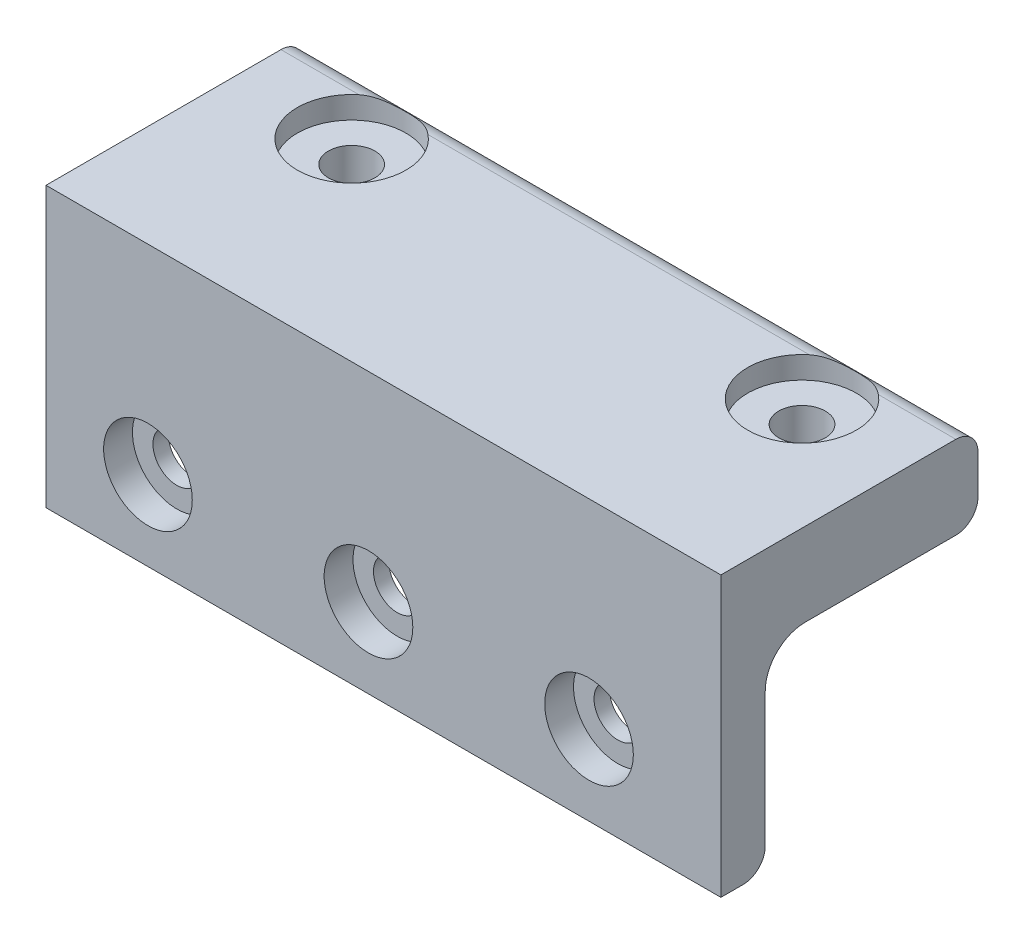
ISO-10303-21;
HEADER;
FILE_DESCRIPTION(('STEP AP214'),'2;1');
FILE_NAME('part.step','',(''),(''),'','','');
FILE_SCHEMA(('AUTOMOTIVE_DESIGN { 1 0 10303 214 1 1 1 1 }'));
ENDSEC;
DATA;
#1=APPLICATION_CONTEXT('core data for automotive mechanical design processes');
#2=APPLICATION_PROTOCOL_DEFINITION('international standard','automotive_design',2000,#1);
#3=PRODUCT_CONTEXT('',#1,'mechanical');
#4=PRODUCT('Part','Part','',(#3));
#5=PRODUCT_RELATED_PRODUCT_CATEGORY('part','',(#4));
#6=PRODUCT_DEFINITION_FORMATION('','',#4);
#7=PRODUCT_DEFINITION_CONTEXT('part definition',#1,'design');
#8=PRODUCT_DEFINITION('design','',#6,#7);
#9=PRODUCT_DEFINITION_SHAPE('','',#8);
#10=(LENGTH_UNIT() NAMED_UNIT(*) SI_UNIT(.MILLI.,.METRE.));
#11=(NAMED_UNIT(*) PLANE_ANGLE_UNIT() SI_UNIT($,.RADIAN.));
#12=(NAMED_UNIT(*) SI_UNIT($,.STERADIAN.) SOLID_ANGLE_UNIT());
#13=UNCERTAINTY_MEASURE_WITH_UNIT(LENGTH_MEASURE(1.E-05),#10,'distance_accuracy_value','');
#14=(GEOMETRIC_REPRESENTATION_CONTEXT(3) GLOBAL_UNCERTAINTY_ASSIGNED_CONTEXT((#13)) GLOBAL_UNIT_ASSIGNED_CONTEXT((#10,
#11,#12)) REPRESENTATION_CONTEXT('',''));
#15=CARTESIAN_POINT('',(0.,0.,0.));
#16=DIRECTION('',(0.,0.,1.));
#17=DIRECTION('',(1.,0.,0.));
#18=AXIS2_PLACEMENT_3D('',#15,#16,#17);
#19=CARTESIAN_POINT('',(0.,0.,-4.));
#20=DIRECTION('',(0.,0.,1.));
#21=DIRECTION('',(1.,0.,0.));
#22=AXIS2_PLACEMENT_3D('',#19,#20,#21);
#23=PLANE('',#22);
#24=CARTESIAN_POINT('',(49.,-18.,-4.));
#25=DIRECTION('',(0.,0.,1.));
#26=DIRECTION('',(1.,0.,0.));
#27=AXIS2_PLACEMENT_3D('',#24,#25,#26);
#28=CIRCLE('',#27,2.15);
#29=CARTESIAN_POINT('',(51.15,-18.,-4.));
#30=VERTEX_POINT('',#29);
#31=EDGE_CURVE('E351',#30,#30,#28,.T.);
#32=ORIENTED_EDGE('',*,*,#31,.T.);
#33=EDGE_LOOP('',(#32));
#34=FACE_BOUND('',#33,.T.);
#35=CARTESIAN_POINT('',(29.1,-18.,-4.));
#36=DIRECTION('',(0.,0.,1.));
#37=DIRECTION('',(1.,0.,0.));
#38=AXIS2_PLACEMENT_3D('',#35,#36,#37);
#39=CIRCLE('',#38,2.15);
#40=CARTESIAN_POINT('',(31.25,-18.,-4.));
#41=VERTEX_POINT('',#40);
#42=EDGE_CURVE('E362',#41,#41,#39,.T.);
#43=ORIENTED_EDGE('',*,*,#42,.T.);
#44=EDGE_LOOP('',(#43));
#45=FACE_BOUND('',#44,.T.);
#46=CARTESIAN_POINT('',(9.2,-18.,-4.));
#47=DIRECTION('',(0.,0.,1.));
#48=DIRECTION('',(1.,0.,0.));
#49=AXIS2_PLACEMENT_3D('',#46,#47,#48);
#50=CIRCLE('',#49,2.15);
#51=CARTESIAN_POINT('',(11.35,-18.,-4.));
#52=VERTEX_POINT('',#51);
#53=EDGE_CURVE('E357',#52,#52,#50,.T.);
#54=ORIENTED_EDGE('',*,*,#53,.T.);
#55=EDGE_LOOP('',(#54));
#56=FACE_BOUND('',#55,.T.);
#57=DIRECTION('',(0.,-1.,0.));
#58=VECTOR('',#57,1.);
#59=CARTESIAN_POINT('',(0.,0.,-4.));
#60=LINE('',#59,#58);
#61=CARTESIAN_POINT('',(0.,-11.1,-4.));
#62=VERTEX_POINT('',#61);
#63=CARTESIAN_POINT('',(0.,-23.2,-4.));
#64=VERTEX_POINT('',#63);
#65=EDGE_CURVE('E180',#62,#64,#60,.T.);
#66=ORIENTED_EDGE('',*,*,#65,.F.);
#67=DIRECTION('',(-1.,0.,0.));
#68=VECTOR('',#67,1.);
#69=CARTESIAN_POINT('',(0.,-11.1,-4.));
#70=LINE('',#69,#68);
#71=CARTESIAN_POINT('',(60.9,-11.1,-4.));
#72=VERTEX_POINT('',#71);
#73=EDGE_CURVE('E69',#62,#72,#70,.F.);
#74=ORIENTED_EDGE('',*,*,#73,.T.);
#75=DIRECTION('',(0.,1.,0.));
#76=VECTOR('',#75,1.);
#77=CARTESIAN_POINT('',(60.9,0.,-4.));
#78=LINE('',#77,#76);
#79=CARTESIAN_POINT('',(60.9,-23.2,-4.));
#80=VERTEX_POINT('',#79);
#81=EDGE_CURVE('E149',#80,#72,#78,.T.);
#82=ORIENTED_EDGE('',*,*,#81,.F.);
#83=DIRECTION('',(1.,0.,0.));
#84=VECTOR('',#83,1.);
#85=CARTESIAN_POINT('',(0.,-23.2,-4.));
#86=LINE('',#85,#84);
#87=EDGE_CURVE('E201',#80,#64,#86,.F.);
#88=ORIENTED_EDGE('',*,*,#87,.T.);
#89=EDGE_LOOP('',(#66,#74,#82,#88));
#90=FACE_BOUND('',#89,.T.);
#91=ADVANCED_FACE('F47',(#34,#45,#56,#90),#23,.F.);
#92=CARTESIAN_POINT('',(0.,0.,-4.));
#93=DIRECTION('',(-1.,0.,0.));
#94=DIRECTION('',(0.,0.,1.));
#95=AXIS2_PLACEMENT_3D('',#92,#93,#94);
#96=PLANE('',#95);
#97=DIRECTION('',(0.,0.,1.));
#98=VECTOR('',#97,1.);
#99=CARTESIAN_POINT('',(0.,-7.5,-4.));
#100=LINE('',#99,#98);
#101=CARTESIAN_POINT('',(0.,-7.5,-21.2));
#102=VERTEX_POINT('',#101);
#103=CARTESIAN_POINT('',(0.,-7.5,-7.6));
#104=VERTEX_POINT('',#103);
#105=EDGE_CURVE('E345',#102,#104,#100,.T.);
#106=ORIENTED_EDGE('',*,*,#105,.T.);
#107=CARTESIAN_POINT('',(0.,-11.1,-7.6));
#108=DIRECTION('',(-1.,0.,0.));
#109=DIRECTION('',(0.,0.,1.));
#110=AXIS2_PLACEMENT_3D('',#107,#108,#109);
#111=CIRCLE('',#110,3.6);
#112=EDGE_CURVE('E56',#104,#62,#111,.F.);
#113=ORIENTED_EDGE('',*,*,#112,.T.);
#114=ORIENTED_EDGE('',*,*,#65,.T.);
#115=CARTESIAN_POINT('',(0.,-23.2,-2.));
#116=DIRECTION('',(-1.,0.,0.));
#117=DIRECTION('',(0.,0.,1.));
#118=AXIS2_PLACEMENT_3D('',#115,#116,#117);
#119=CIRCLE('',#118,2.);
#120=CARTESIAN_POINT('',(0.,-25.2,-2.));
#121=VERTEX_POINT('',#120);
#122=EDGE_CURVE('E143',#64,#121,#119,.T.);
#123=ORIENTED_EDGE('',*,*,#122,.T.);
#124=DIRECTION('',(0.,0.,1.));
#125=VECTOR('',#124,1.);
#126=CARTESIAN_POINT('',(0.,-25.2,-4.));
#127=LINE('',#126,#125);
#128=CARTESIAN_POINT('',(0.,-25.2,0.));
#129=VERTEX_POINT('',#128);
#130=EDGE_CURVE('E135',#121,#129,#127,.T.);
#131=ORIENTED_EDGE('',*,*,#130,.T.);
#132=DIRECTION('',(0.,-1.,0.));
#133=VECTOR('',#132,1.);
#134=CARTESIAN_POINT('',(0.,0.,0.));
#135=LINE('',#134,#133);
#136=CARTESIAN_POINT('',(0.,0.,0.));
#137=VERTEX_POINT('',#136);
#138=EDGE_CURVE('E140',#137,#129,#135,.T.);
#139=ORIENTED_EDGE('',*,*,#138,.F.);
#140=DIRECTION('',(0.,0.,1.));
#141=VECTOR('',#140,1.);
#142=CARTESIAN_POINT('',(0.,0.,-4.));
#143=LINE('',#142,#141);
#144=CARTESIAN_POINT('',(0.,0.,-21.2));
#145=VERTEX_POINT('',#144);
#146=EDGE_CURVE('E181',#145,#137,#143,.T.);
#147=ORIENTED_EDGE('',*,*,#146,.F.);
#148=CARTESIAN_POINT('',(0.,-2.,-21.2));
#149=DIRECTION('',(-1.,0.,0.));
#150=DIRECTION('',(0.,0.,1.));
#151=AXIS2_PLACEMENT_3D('',#148,#149,#150);
#152=CIRCLE('',#151,2.);
#153=CARTESIAN_POINT('',(0.,-2.,-23.2));
#154=VERTEX_POINT('',#153);
#155=EDGE_CURVE('E205',#145,#154,#152,.T.);
#156=ORIENTED_EDGE('',*,*,#155,.T.);
#157=DIRECTION('',(0.,-1.,0.));
#158=VECTOR('',#157,1.);
#159=CARTESIAN_POINT('',(0.,-7.5,-23.2));
#160=LINE('',#159,#158);
#161=CARTESIAN_POINT('',(0.,-5.5,-23.2));
#162=VERTEX_POINT('',#161);
#163=EDGE_CURVE('E353',#154,#162,#160,.T.);
#164=ORIENTED_EDGE('',*,*,#163,.T.);
#165=CARTESIAN_POINT('',(0.,-5.5,-21.2));
#166=DIRECTION('',(-1.,0.,0.));
#167=DIRECTION('',(0.,0.,1.));
#168=AXIS2_PLACEMENT_3D('',#165,#166,#167);
#169=CIRCLE('',#168,2.);
#170=EDGE_CURVE('E208',#162,#102,#169,.T.);
#171=ORIENTED_EDGE('',*,*,#170,.T.);
#172=EDGE_LOOP('',(#106,#113,#114,#123,#131,#139,#147,#156,#164,#171));
#173=FACE_BOUND('',#172,.T.);
#174=ADVANCED_FACE('F137',(#173),#96,.T.);
#175=CARTESIAN_POINT('',(0.,0.,-4.));
#176=DIRECTION('',(0.,1.,0.));
#177=DIRECTION('',(0.,0.,1.));
#178=AXIS2_PLACEMENT_3D('',#175,#176,#177);
#179=PLANE('',#178);
#180=DIRECTION('',(0.,0.,1.));
#181=VECTOR('',#180,1.);
#182=CARTESIAN_POINT('',(60.9,0.,-4.));
#183=LINE('',#182,#181);
#184=CARTESIAN_POINT('',(60.9,0.,-21.2));
#185=VERTEX_POINT('',#184);
#186=CARTESIAN_POINT('',(60.9,0.,0.));
#187=VERTEX_POINT('',#186);
#188=EDGE_CURVE('E185',#185,#187,#183,.T.);
#189=ORIENTED_EDGE('',*,*,#188,.F.);
#190=DIRECTION('',(-1.,0.,0.));
#191=VECTOR('',#190,1.);
#192=CARTESIAN_POINT('',(0.,0.,-21.2));
#193=LINE('',#192,#191);
#194=CARTESIAN_POINT('',(53.9179480431848,0.,-21.2));
#195=VERTEX_POINT('',#194);
#196=EDGE_CURVE('E229',#185,#195,#193,.T.);
#197=ORIENTED_EDGE('',*,*,#196,.T.);
#198=CARTESIAN_POINT('',(50.8,0.,-17.42));
#199=DIRECTION('',(0.,1.,0.));
#200=DIRECTION('',(0.,0.,1.));
#201=AXIS2_PLACEMENT_3D('',#198,#199,#200);
#202=CIRCLE('',#201,4.9);
#203=CARTESIAN_POINT('',(47.6820519568152,0.,-21.2));
#204=VERTEX_POINT('',#203);
#205=EDGE_CURVE('E519',#204,#195,#202,.T.);
#206=ORIENTED_EDGE('',*,*,#205,.F.);
#207=DIRECTION('',(-1.,0.,0.));
#208=VECTOR('',#207,1.);
#209=CARTESIAN_POINT('',(0.,0.,-21.2));
#210=LINE('',#209,#208);
#211=CARTESIAN_POINT('',(13.2779480431848,0.,-21.2));
#212=VERTEX_POINT('',#211);
#213=EDGE_CURVE('E226',#204,#212,#210,.T.);
#214=ORIENTED_EDGE('',*,*,#213,.T.);
#215=CARTESIAN_POINT('',(10.16,0.,-17.42));
#216=DIRECTION('',(0.,1.,0.));
#217=DIRECTION('',(0.,0.,1.));
#218=AXIS2_PLACEMENT_3D('',#215,#216,#217);
#219=CIRCLE('',#218,4.9);
#220=CARTESIAN_POINT('',(7.04205195681517,0.,-21.2));
#221=VERTEX_POINT('',#220);
#222=EDGE_CURVE('E507',#221,#212,#219,.T.);
#223=ORIENTED_EDGE('',*,*,#222,.F.);
#224=DIRECTION('',(-1.,0.,0.));
#225=VECTOR('',#224,1.);
#226=CARTESIAN_POINT('',(0.,0.,-21.2));
#227=LINE('',#226,#225);
#228=EDGE_CURVE('E223',#221,#145,#227,.T.);
#229=ORIENTED_EDGE('',*,*,#228,.T.);
#230=ORIENTED_EDGE('',*,*,#146,.T.);
#231=DIRECTION('',(-1.,0.,0.));
#232=VECTOR('',#231,1.);
#233=CARTESIAN_POINT('',(0.,0.,0.));
#234=LINE('',#233,#232);
#235=EDGE_CURVE('E163',#187,#137,#234,.T.);
#236=ORIENTED_EDGE('',*,*,#235,.F.);
#237=EDGE_LOOP('',(#189,#197,#206,#214,#223,#229,#230,#236));
#238=FACE_BOUND('',#237,.T.);
#239=ADVANCED_FACE('F308',(#238),#179,.T.);
#240=CARTESIAN_POINT('',(60.9,0.,-4.));
#241=DIRECTION('',(1.,0.,0.));
#242=DIRECTION('',(0.,0.,-1.));
#243=AXIS2_PLACEMENT_3D('',#240,#241,#242);
#244=PLANE('',#243);
#245=DIRECTION('',(0.,0.,1.));
#246=VECTOR('',#245,1.);
#247=CARTESIAN_POINT('',(60.9,-25.2,-4.));
#248=LINE('',#247,#246);
#249=CARTESIAN_POINT('',(60.9,-25.2,-2.));
#250=VERTEX_POINT('',#249);
#251=CARTESIAN_POINT('',(60.9,-25.2,0.));
#252=VERTEX_POINT('',#251);
#253=EDGE_CURVE('E148',#250,#252,#248,.T.);
#254=ORIENTED_EDGE('',*,*,#253,.F.);
#255=CARTESIAN_POINT('',(60.9,-23.2,-2.));
#256=DIRECTION('',(1.,0.,0.));
#257=DIRECTION('',(0.,0.,-1.));
#258=AXIS2_PLACEMENT_3D('',#255,#256,#257);
#259=CIRCLE('',#258,2.);
#260=EDGE_CURVE('E198',#250,#80,#259,.T.);
#261=ORIENTED_EDGE('',*,*,#260,.T.);
#262=ORIENTED_EDGE('',*,*,#81,.T.);
#263=CARTESIAN_POINT('',(60.9,-11.1,-7.6));
#264=DIRECTION('',(1.,0.,0.));
#265=DIRECTION('',(0.,0.,-1.));
#266=AXIS2_PLACEMENT_3D('',#263,#264,#265);
#267=CIRCLE('',#266,3.6);
#268=CARTESIAN_POINT('',(60.9,-7.5,-7.6));
#269=VERTEX_POINT('',#268);
#270=EDGE_CURVE('E11',#72,#269,#267,.F.);
#271=ORIENTED_EDGE('',*,*,#270,.T.);
#272=DIRECTION('',(0.,0.,1.));
#273=VECTOR('',#272,1.);
#274=CARTESIAN_POINT('',(60.9,-7.5,-4.));
#275=LINE('',#274,#273);
#276=CARTESIAN_POINT('',(60.9,-7.5,-21.2));
#277=VERTEX_POINT('',#276);
#278=EDGE_CURVE('E340',#277,#269,#275,.T.);
#279=ORIENTED_EDGE('',*,*,#278,.F.);
#280=CARTESIAN_POINT('',(60.9,-5.5,-21.2));
#281=DIRECTION('',(1.,0.,0.));
#282=DIRECTION('',(0.,0.,-1.));
#283=AXIS2_PLACEMENT_3D('',#280,#281,#282);
#284=CIRCLE('',#283,2.);
#285=CARTESIAN_POINT('',(60.9,-5.5,-23.2));
#286=VERTEX_POINT('',#285);
#287=EDGE_CURVE('E195',#277,#286,#284,.T.);
#288=ORIENTED_EDGE('',*,*,#287,.T.);
#289=DIRECTION('',(0.,-1.,0.));
#290=VECTOR('',#289,1.);
#291=CARTESIAN_POINT('',(60.9,-7.5,-23.2));
#292=LINE('',#291,#290);
#293=CARTESIAN_POINT('',(60.9,-2.,-23.2));
#294=VERTEX_POINT('',#293);
#295=EDGE_CURVE('E337',#294,#286,#292,.T.);
#296=ORIENTED_EDGE('',*,*,#295,.F.);
#297=CARTESIAN_POINT('',(60.9,-2.,-21.2));
#298=DIRECTION('',(1.,0.,0.));
#299=DIRECTION('',(0.,0.,-1.));
#300=AXIS2_PLACEMENT_3D('',#297,#298,#299);
#301=CIRCLE('',#300,2.);
#302=EDGE_CURVE('E192',#294,#185,#301,.T.);
#303=ORIENTED_EDGE('',*,*,#302,.T.);
#304=ORIENTED_EDGE('',*,*,#188,.T.);
#305=DIRECTION('',(0.,1.,0.));
#306=VECTOR('',#305,1.);
#307=CARTESIAN_POINT('',(60.9,0.,0.));
#308=LINE('',#307,#306);
#309=EDGE_CURVE('E159',#252,#187,#308,.T.);
#310=ORIENTED_EDGE('',*,*,#309,.F.);
#311=EDGE_LOOP('',(#254,#261,#262,#271,#279,#288,#296,#303,#304,#310));
#312=FACE_BOUND('',#311,.T.);
#313=ADVANCED_FACE('F311',(#312),#244,.T.);
#314=CARTESIAN_POINT('',(0.,-25.2,-4.));
#315=DIRECTION('',(0.,-1.,0.));
#316=DIRECTION('',(0.,0.,-1.));
#317=AXIS2_PLACEMENT_3D('',#314,#315,#316);
#318=PLANE('',#317);
#319=ORIENTED_EDGE('',*,*,#130,.F.);
#320=DIRECTION('',(1.,0.,0.));
#321=VECTOR('',#320,1.);
#322=CARTESIAN_POINT('',(60.9,-25.2,-2.));
#323=LINE('',#322,#321);
#324=EDGE_CURVE('E184',#121,#250,#323,.T.);
#325=ORIENTED_EDGE('',*,*,#324,.T.);
#326=ORIENTED_EDGE('',*,*,#253,.T.);
#327=DIRECTION('',(1.,0.,0.));
#328=VECTOR('',#327,1.);
#329=CARTESIAN_POINT('',(0.,-25.2,0.));
#330=LINE('',#329,#328);
#331=EDGE_CURVE('E152',#129,#252,#330,.T.);
#332=ORIENTED_EDGE('',*,*,#331,.F.);
#333=EDGE_LOOP('',(#319,#325,#326,#332));
#334=FACE_BOUND('',#333,.T.);
#335=ADVANCED_FACE('F153',(#334),#318,.T.);
#336=CARTESIAN_POINT('',(0.,0.,0.));
#337=DIRECTION('',(0.,0.,1.));
#338=DIRECTION('',(1.,0.,0.));
#339=AXIS2_PLACEMENT_3D('',#336,#337,#338);
#340=PLANE('',#339);
#341=CARTESIAN_POINT('',(9.2,-18.,0.));
#342=DIRECTION('',(0.,0.,1.));
#343=DIRECTION('',(1.,0.,0.));
#344=AXIS2_PLACEMENT_3D('',#341,#342,#343);
#345=CIRCLE('',#344,4.);
#346=CARTESIAN_POINT('',(13.2,-18.,0.));
#347=VERTEX_POINT('',#346);
#348=EDGE_CURVE('E171',#347,#347,#345,.T.);
#349=ORIENTED_EDGE('',*,*,#348,.F.);
#350=EDGE_LOOP('',(#349));
#351=FACE_BOUND('',#350,.T.);
#352=CARTESIAN_POINT('',(29.1,-18.,0.));
#353=DIRECTION('',(0.,0.,1.));
#354=DIRECTION('',(1.,0.,0.));
#355=AXIS2_PLACEMENT_3D('',#352,#353,#354);
#356=CIRCLE('',#355,4.00000000000001);
#357=CARTESIAN_POINT('',(33.1,-18.,0.));
#358=VERTEX_POINT('',#357);
#359=EDGE_CURVE('E388',#358,#358,#356,.T.);
#360=ORIENTED_EDGE('',*,*,#359,.F.);
#361=EDGE_LOOP('',(#360));
#362=FACE_BOUND('',#361,.T.);
#363=CARTESIAN_POINT('',(49.,-18.,0.));
#364=DIRECTION('',(0.,0.,1.));
#365=DIRECTION('',(1.,0.,0.));
#366=AXIS2_PLACEMENT_3D('',#363,#364,#365);
#367=CIRCLE('',#366,4.00000000000001);
#368=CARTESIAN_POINT('',(53.,-18.,0.));
#369=VERTEX_POINT('',#368);
#370=EDGE_CURVE('E379',#369,#369,#367,.T.);
#371=ORIENTED_EDGE('',*,*,#370,.F.);
#372=EDGE_LOOP('',(#371));
#373=FACE_BOUND('',#372,.T.);
#374=ORIENTED_EDGE('',*,*,#138,.T.);
#375=ORIENTED_EDGE('',*,*,#331,.T.);
#376=ORIENTED_EDGE('',*,*,#309,.T.);
#377=ORIENTED_EDGE('',*,*,#235,.T.);
#378=EDGE_LOOP('',(#374,#375,#376,#377));
#379=FACE_BOUND('',#378,.T.);
#380=ADVANCED_FACE('F161',(#351,#362,#373,#379),#340,.T.);
#381=CARTESIAN_POINT('',(49.,-18.,-2.6));
#382=DIRECTION('',(0.,0.,1.));
#383=DIRECTION('',(1.,0.,0.));
#384=AXIS2_PLACEMENT_3D('',#381,#382,#383);
#385=CYLINDRICAL_SURFACE('',#384,4.00000000000001);
#386=CARTESIAN_POINT('',(49.,-18.,-2.6));
#387=DIRECTION('',(0.,0.,1.));
#388=DIRECTION('',(1.,0.,0.));
#389=AXIS2_PLACEMENT_3D('',#386,#387,#388);
#390=CIRCLE('',#389,4.00000000000001);
#391=CARTESIAN_POINT('',(53.,-18.,-2.6));
#392=VERTEX_POINT('',#391);
#393=EDGE_CURVE('E392',#392,#392,#390,.T.);
#394=ORIENTED_EDGE('',*,*,#393,.F.);
#395=EDGE_LOOP('',(#394));
#396=FACE_BOUND('',#395,.T.);
#397=ORIENTED_EDGE('',*,*,#370,.T.);
#398=EDGE_LOOP('',(#397));
#399=FACE_BOUND('',#398,.T.);
#400=ADVANCED_FACE('F297',(#396,#399),#385,.F.);
#401=CARTESIAN_POINT('',(49.,-18.,-2.6));
#402=DIRECTION('',(0.,0.,1.));
#403=DIRECTION('',(1.,0.,0.));
#404=AXIS2_PLACEMENT_3D('',#401,#402,#403);
#405=PLANE('',#404);
#406=CARTESIAN_POINT('',(49.,-18.,-2.6));
#407=DIRECTION('',(0.,0.,1.));
#408=DIRECTION('',(1.,0.,0.));
#409=AXIS2_PLACEMENT_3D('',#406,#407,#408);
#410=CIRCLE('',#409,2.15);
#411=CARTESIAN_POINT('',(51.15,-18.,-2.6));
#412=VERTEX_POINT('',#411);
#413=EDGE_CURVE('E376',#412,#412,#410,.T.);
#414=ORIENTED_EDGE('',*,*,#413,.F.);
#415=EDGE_LOOP('',(#414));
#416=FACE_BOUND('',#415,.T.);
#417=ORIENTED_EDGE('',*,*,#393,.T.);
#418=EDGE_LOOP('',(#417));
#419=FACE_BOUND('',#418,.T.);
#420=ADVANCED_FACE('F293',(#416,#419),#405,.T.);
#421=CARTESIAN_POINT('',(29.1,-18.,-2.6));
#422=DIRECTION('',(0.,0.,1.));
#423=DIRECTION('',(1.,0.,0.));
#424=AXIS2_PLACEMENT_3D('',#421,#422,#423);
#425=CYLINDRICAL_SURFACE('',#424,4.00000000000001);
#426=CARTESIAN_POINT('',(29.1,-18.,-2.6));
#427=DIRECTION('',(0.,0.,1.));
#428=DIRECTION('',(1.,0.,0.));
#429=AXIS2_PLACEMENT_3D('',#426,#427,#428);
#430=CIRCLE('',#429,4.00000000000001);
#431=CARTESIAN_POINT('',(33.1,-18.,-2.6));
#432=VERTEX_POINT('',#431);
#433=EDGE_CURVE('E384',#432,#432,#430,.T.);
#434=ORIENTED_EDGE('',*,*,#433,.F.);
#435=EDGE_LOOP('',(#434));
#436=FACE_BOUND('',#435,.T.);
#437=ORIENTED_EDGE('',*,*,#359,.T.);
#438=EDGE_LOOP('',(#437));
#439=FACE_BOUND('',#438,.T.);
#440=ADVANCED_FACE('F289',(#436,#439),#425,.F.);
#441=CARTESIAN_POINT('',(29.1,-18.,-2.6));
#442=DIRECTION('',(0.,0.,1.));
#443=DIRECTION('',(1.,0.,0.));
#444=AXIS2_PLACEMENT_3D('',#441,#442,#443);
#445=PLANE('',#444);
#446=CARTESIAN_POINT('',(29.1,-18.,-2.6));
#447=DIRECTION('',(0.,0.,1.));
#448=DIRECTION('',(1.,0.,0.));
#449=AXIS2_PLACEMENT_3D('',#446,#447,#448);
#450=CIRCLE('',#449,2.15);
#451=CARTESIAN_POINT('',(31.25,-18.,-2.6));
#452=VERTEX_POINT('',#451);
#453=EDGE_CURVE('E372',#452,#452,#450,.T.);
#454=ORIENTED_EDGE('',*,*,#453,.F.);
#455=EDGE_LOOP('',(#454));
#456=FACE_BOUND('',#455,.T.);
#457=ORIENTED_EDGE('',*,*,#433,.T.);
#458=EDGE_LOOP('',(#457));
#459=FACE_BOUND('',#458,.T.);
#460=ADVANCED_FACE('F285',(#456,#459),#445,.T.);
#461=CARTESIAN_POINT('',(9.2,-18.,-2.6));
#462=DIRECTION('',(0.,0.,1.));
#463=DIRECTION('',(1.,0.,0.));
#464=AXIS2_PLACEMENT_3D('',#461,#462,#463);
#465=CYLINDRICAL_SURFACE('',#464,4.);
#466=CARTESIAN_POINT('',(9.2,-18.,-2.6));
#467=DIRECTION('',(0.,0.,1.));
#468=DIRECTION('',(1.,0.,0.));
#469=AXIS2_PLACEMENT_3D('',#466,#467,#468);
#470=CIRCLE('',#469,4.);
#471=CARTESIAN_POINT('',(13.2,-18.,-2.6));
#472=VERTEX_POINT('',#471);
#473=EDGE_CURVE('E165',#472,#472,#470,.T.);
#474=ORIENTED_EDGE('',*,*,#473,.F.);
#475=EDGE_LOOP('',(#474));
#476=FACE_BOUND('',#475,.T.);
#477=ORIENTED_EDGE('',*,*,#348,.T.);
#478=EDGE_LOOP('',(#477));
#479=FACE_BOUND('',#478,.T.);
#480=ADVANCED_FACE('F281',(#476,#479),#465,.F.);
#481=CARTESIAN_POINT('',(9.2,-18.,-2.6));
#482=DIRECTION('',(0.,0.,1.));
#483=DIRECTION('',(1.,0.,0.));
#484=AXIS2_PLACEMENT_3D('',#481,#482,#483);
#485=PLANE('',#484);
#486=CARTESIAN_POINT('',(9.2,-18.,-2.6));
#487=DIRECTION('',(0.,0.,1.));
#488=DIRECTION('',(1.,0.,0.));
#489=AXIS2_PLACEMENT_3D('',#486,#487,#488);
#490=CIRCLE('',#489,2.15);
#491=CARTESIAN_POINT('',(11.35,-18.,-2.6));
#492=VERTEX_POINT('',#491);
#493=EDGE_CURVE('E361',#492,#492,#490,.T.);
#494=ORIENTED_EDGE('',*,*,#493,.F.);
#495=EDGE_LOOP('',(#494));
#496=FACE_BOUND('',#495,.T.);
#497=ORIENTED_EDGE('',*,*,#473,.T.);
#498=EDGE_LOOP('',(#497));
#499=FACE_BOUND('',#498,.T.);
#500=ADVANCED_FACE('F271',(#496,#499),#485,.T.);
#501=CARTESIAN_POINT('',(9.2,-18.,-4.));
#502=DIRECTION('',(0.,0.,1.));
#503=DIRECTION('',(1.,0.,0.));
#504=AXIS2_PLACEMENT_3D('',#501,#502,#503);
#505=CYLINDRICAL_SURFACE('',#504,2.15);
#506=ORIENTED_EDGE('',*,*,#493,.T.);
#507=EDGE_LOOP('',(#506));
#508=FACE_BOUND('',#507,.T.);
#509=ORIENTED_EDGE('',*,*,#53,.F.);
#510=EDGE_LOOP('',(#509));
#511=FACE_BOUND('',#510,.T.);
#512=ADVANCED_FACE('F267',(#508,#511),#505,.F.);
#513=CARTESIAN_POINT('',(29.1,-18.,-4.));
#514=DIRECTION('',(0.,0.,1.));
#515=DIRECTION('',(1.,0.,0.));
#516=AXIS2_PLACEMENT_3D('',#513,#514,#515);
#517=CYLINDRICAL_SURFACE('',#516,2.15);
#518=ORIENTED_EDGE('',*,*,#453,.T.);
#519=EDGE_LOOP('',(#518));
#520=FACE_BOUND('',#519,.T.);
#521=ORIENTED_EDGE('',*,*,#42,.F.);
#522=EDGE_LOOP('',(#521));
#523=FACE_BOUND('',#522,.T.);
#524=ADVANCED_FACE('F270',(#520,#523),#517,.F.);
#525=CARTESIAN_POINT('',(49.,-18.,-4.));
#526=DIRECTION('',(0.,0.,1.));
#527=DIRECTION('',(1.,0.,0.));
#528=AXIS2_PLACEMENT_3D('',#525,#526,#527);
#529=CYLINDRICAL_SURFACE('',#528,2.15);
#530=ORIENTED_EDGE('',*,*,#413,.T.);
#531=EDGE_LOOP('',(#530));
#532=FACE_BOUND('',#531,.T.);
#533=ORIENTED_EDGE('',*,*,#31,.F.);
#534=EDGE_LOOP('',(#533));
#535=FACE_BOUND('',#534,.T.);
#536=ADVANCED_FACE('F265',(#532,#535),#529,.F.);
#537=CARTESIAN_POINT('',(81.5128600635622,-7.5,-23.2));
#538=DIRECTION('',(0.,0.,-1.));
#539=DIRECTION('',(-1.,0.,0.));
#540=AXIS2_PLACEMENT_3D('',#537,#538,#539);
#541=PLANE('',#540);
#542=ORIENTED_EDGE('',*,*,#295,.T.);
#543=DIRECTION('',(-1.,0.,0.));
#544=VECTOR('',#543,1.);
#545=CARTESIAN_POINT('',(81.5128600635622,-5.5,-23.2));
#546=LINE('',#545,#544);
#547=EDGE_CURVE('E216',#286,#162,#546,.T.);
#548=ORIENTED_EDGE('',*,*,#547,.T.);
#549=ORIENTED_EDGE('',*,*,#163,.F.);
#550=DIRECTION('',(-1.,0.,0.));
#551=VECTOR('',#550,1.);
#552=CARTESIAN_POINT('',(81.5128600635622,-2.,-23.2));
#553=LINE('',#552,#551);
#554=EDGE_CURVE('E213',#154,#294,#553,.F.);
#555=ORIENTED_EDGE('',*,*,#554,.T.);
#556=EDGE_LOOP('',(#542,#548,#549,#555));
#557=FACE_BOUND('',#556,.T.);
#558=ADVANCED_FACE('F261',(#557),#541,.T.);
#559=CARTESIAN_POINT('',(81.5128600635622,-7.5,-4.));
#560=DIRECTION('',(0.,-1.,0.));
#561=DIRECTION('',(0.,0.,-1.));
#562=AXIS2_PLACEMENT_3D('',#559,#560,#561);
#563=PLANE('',#562);
#564=CARTESIAN_POINT('',(10.16,-7.5,-17.42));
#565=DIRECTION('',(0.,-1.,0.));
#566=DIRECTION('',(0.,0.,-1.));
#567=AXIS2_PLACEMENT_3D('',#564,#565,#566);
#568=CIRCLE('',#567,2.1);
#569=CARTESIAN_POINT('',(10.16,-7.5,-19.52));
#570=VERTEX_POINT('',#569);
#571=EDGE_CURVE('E537',#570,#570,#568,.T.);
#572=ORIENTED_EDGE('',*,*,#571,.F.);
#573=EDGE_LOOP('',(#572));
#574=FACE_BOUND('',#573,.T.);
#575=CARTESIAN_POINT('',(50.8,-7.5,-17.42));
#576=DIRECTION('',(0.,-1.,0.));
#577=DIRECTION('',(0.,0.,-1.));
#578=AXIS2_PLACEMENT_3D('',#575,#576,#577);
#579=CIRCLE('',#578,2.1);
#580=CARTESIAN_POINT('',(50.8,-7.5,-19.52));
#581=VERTEX_POINT('',#580);
#582=EDGE_CURVE('E525',#581,#581,#579,.T.);
#583=ORIENTED_EDGE('',*,*,#582,.F.);
#584=EDGE_LOOP('',(#583));
#585=FACE_BOUND('',#584,.T.);
#586=ORIENTED_EDGE('',*,*,#278,.T.);
#587=DIRECTION('',(-1.,0.,0.));
#588=VECTOR('',#587,1.);
#589=CARTESIAN_POINT('',(81.5128600635622,-7.5,-7.6));
#590=LINE('',#589,#588);
#591=EDGE_CURVE('E409',#269,#104,#590,.T.);
#592=ORIENTED_EDGE('',*,*,#591,.T.);
#593=ORIENTED_EDGE('',*,*,#105,.F.);
#594=DIRECTION('',(-1.,0.,0.));
#595=VECTOR('',#594,1.);
#596=CARTESIAN_POINT('',(81.5128600635622,-7.5,-21.2));
#597=LINE('',#596,#595);
#598=EDGE_CURVE('E220',#102,#277,#597,.F.);
#599=ORIENTED_EDGE('',*,*,#598,.T.);
#600=EDGE_LOOP('',(#586,#592,#593,#599));
#601=FACE_BOUND('',#600,.T.);
#602=ADVANCED_FACE('F257',(#574,#585,#601),#563,.T.);
#603=CARTESIAN_POINT('',(50.8,-2.,-17.42));
#604=DIRECTION('',(0.,1.,0.));
#605=DIRECTION('',(0.,0.,1.));
#606=AXIS2_PLACEMENT_3D('',#603,#604,#605);
#607=CYLINDRICAL_SURFACE('',#606,4.9);
#608=CARTESIAN_POINT('',(50.8,-2.,-17.42));
#609=DIRECTION('',(0.,1.,0.));
#610=DIRECTION('',(0.,0.,1.));
#611=AXIS2_PLACEMENT_3D('',#608,#609,#610);
#612=CIRCLE('',#611,4.9);
#613=CARTESIAN_POINT('',(50.8,-2.,-12.52));
#614=VERTEX_POINT('',#613);
#615=EDGE_CURVE('E513',#614,#614,#612,.T.);
#616=ORIENTED_EDGE('',*,*,#615,.F.);
#617=EDGE_LOOP('',(#616));
#618=FACE_BOUND('',#617,.T.);
#619=ORIENTED_EDGE('',*,*,#205,.T.);
#620=CARTESIAN_POINT('',(53.9179480431848,0.,-21.2));
#621=CARTESIAN_POINT('',(53.8286225644209,-3.0675038264168E-05,-21.2736980878322));
#622=CARTESIAN_POINT('',(53.7367648734642,-0.00406936007128253,-21.3441290641825));
#623=CARTESIAN_POINT('',(53.5487647093001,-0.0182695866944448,-21.4780231219697));
#624=CARTESIAN_POINT('',(53.4526296124482,-0.0284209391845195,-21.5414975914282));
#625=CARTESIAN_POINT('',(53.2564927669105,-0.052973509863096,-21.6613289961353));
#626=CARTESIAN_POINT('',(53.1564886728501,-0.0673773421125995,-21.7176815229043));
#627=CARTESIAN_POINT('',(52.9530892551673,-0.0987468928164648,-21.8231061956685));
#628=CARTESIAN_POINT('',(52.8496923379121,-0.115713829062475,-21.8721748588368));
#629=CARTESIAN_POINT('',(52.5251378285631,-0.16964317339516,-22.0125033307448));
#630=CARTESIAN_POINT('',(52.2986495393839,-0.208213408446666,-22.0913431852526));
#631=CARTESIAN_POINT('',(51.9514972089685,-0.258617100257546,-22.184284449134));
#632=CARTESIAN_POINT('',(51.8345893399293,-0.274171851852822,-22.2110397078179));
#633=CARTESIAN_POINT('',(51.5986933592542,-0.301281069561712,-22.2559574648274));
#634=CARTESIAN_POINT('',(51.4797063285671,-0.312837552961654,-22.2741242980576));
#635=CARTESIAN_POINT('',(51.2259317059516,-0.331755863979286,-22.3033174877994));
#636=CARTESIAN_POINT('',(51.0909621125236,-0.338447563191601,-22.3132247965783));
#637=CARTESIAN_POINT('',(50.8204964894312,-0.344241176294927,-22.3218246437891));
#638=CARTESIAN_POINT('',(50.685000455213,-0.343343024386568,-22.3205170849949));
#639=CARTESIAN_POINT('',(50.4146088610989,-0.334081753192582,-22.3066995378873));
#640=CARTESIAN_POINT('',(50.2797147572726,-0.325705640507999,-22.294170050688));
#641=CARTESIAN_POINT('',(50.0119844453416,-0.302692620863404,-22.2581082106502));
#642=CARTESIAN_POINT('',(49.8791483937745,-0.288055240063885,-22.2345750250625));
#643=CARTESIAN_POINT('',(49.5191682591489,-0.241996902905852,-22.1554245283381));
#644=CARTESIAN_POINT('',(49.2949259708706,-0.206169085939181,-22.0889503655215));
#645=CARTESIAN_POINT('',(48.8587434120391,-0.133925037975235,-21.925078483642));
#646=CARTESIAN_POINT('',(48.6467784710148,-0.0975101892869351,-21.8277455170835));
#647=CARTESIAN_POINT('',(48.3085142349436,-0.0479883270994945,-21.6420468590218));
#648=CARTESIAN_POINT('',(48.178031024732,-0.0311787991649147,-21.562307944892));
#649=CARTESIAN_POINT('',(47.9877617520339,-0.0131881402852733,-21.4333784099841));
#650=CARTESIAN_POINT('',(47.9251811912199,-0.00839389238785822,-21.3887934350069));
#651=CARTESIAN_POINT('',(47.8020391347446,-0.00180146380879246,-21.296616618862));
#652=CARTESIAN_POINT('',(47.7414792752736,-5.65595136367018E-06,-21.2490224272222));
#653=CARTESIAN_POINT('',(47.6820519568152,0.,-21.2));
#654=B_SPLINE_CURVE_WITH_KNOTS('',3,(#620,#621,#622,#623,#624,#625,#626,#627,#628,#629,#630,
#631,#632,#633,#634,#635,#636,#637,#638,#639,#640,#641,#642,#643,#644,#645,#646,#647,#648,#649,
#650,#651,#652,#653),.UNSPECIFIED.,.F.,.F.,(4,2,2,2,2,2,2,2,2,2,2,2,2,2,2,2,4),(0.,
0.347088434224056,0.693599908109185,1.04032483271248,1.38721501573261,2.11280285534163,
2.47531901717803,2.83765200745486,3.24348348450476,3.64931847986902,4.05586001291873,
4.46243231761509,5.16966415589307,5.87542168980395,6.33605671444324,6.56688959838062,
6.79790506616343),.UNSPECIFIED.);
#655=EDGE_CURVE('E233',#195,#204,#654,.T.);
#656=ORIENTED_EDGE('',*,*,#655,.T.);
#657=EDGE_LOOP('',(#619,#656));
#658=FACE_BOUND('',#657,.T.);
#659=ADVANCED_FACE('F251',(#618,#658),#607,.F.);
#660=CARTESIAN_POINT('',(50.8,-2.,-17.42));
#661=DIRECTION('',(0.,1.,0.));
#662=DIRECTION('',(0.,0.,1.));
#663=AXIS2_PLACEMENT_3D('',#660,#661,#662);
#664=PLANE('',#663);
#665=CARTESIAN_POINT('',(50.8,-2.,-17.42));
#666=DIRECTION('',(0.,1.,0.));
#667=DIRECTION('',(0.,0.,1.));
#668=AXIS2_PLACEMENT_3D('',#665,#666,#667);
#669=CIRCLE('',#668,2.1);
#670=CARTESIAN_POINT('',(50.8,-2.,-15.32));
#671=VERTEX_POINT('',#670);
#672=EDGE_CURVE('E531',#671,#671,#669,.T.);
#673=ORIENTED_EDGE('',*,*,#672,.F.);
#674=EDGE_LOOP('',(#673));
#675=FACE_BOUND('',#674,.T.);
#676=ORIENTED_EDGE('',*,*,#615,.T.);
#677=EDGE_LOOP('',(#676));
#678=FACE_BOUND('',#677,.T.);
#679=ADVANCED_FACE('F256',(#675,#678),#664,.T.);
#680=CARTESIAN_POINT('',(10.16,-2.,-17.42));
#681=DIRECTION('',(0.,1.,0.));
#682=DIRECTION('',(0.,0.,1.));
#683=AXIS2_PLACEMENT_3D('',#680,#681,#682);
#684=CYLINDRICAL_SURFACE('',#683,4.9);
#685=CARTESIAN_POINT('',(10.16,-2.,-17.42));
#686=DIRECTION('',(0.,1.,0.));
#687=DIRECTION('',(0.,0.,1.));
#688=AXIS2_PLACEMENT_3D('',#685,#686,#687);
#689=CIRCLE('',#688,4.9);
#690=CARTESIAN_POINT('',(10.16,-2.,-12.52));
#691=VERTEX_POINT('',#690);
#692=EDGE_CURVE('E502',#691,#691,#689,.T.);
#693=ORIENTED_EDGE('',*,*,#692,.F.);
#694=EDGE_LOOP('',(#693));
#695=FACE_BOUND('',#694,.T.);
#696=ORIENTED_EDGE('',*,*,#222,.T.);
#697=CARTESIAN_POINT('',(13.2779480431848,0.,-21.2));
#698=CARTESIAN_POINT('',(13.1886225644209,-3.06750382638274E-05,-21.2736980878322));
#699=CARTESIAN_POINT('',(13.0967648734642,-0.00406936007128211,-21.3441290641825));
#700=CARTESIAN_POINT('',(12.9087647093001,-0.0182695866944444,-21.4780231219697));
#701=CARTESIAN_POINT('',(12.8126296124482,-0.0284209391845191,-21.5414975914282));
#702=CARTESIAN_POINT('',(12.6164927669105,-0.0529735098630955,-21.6613289961353));
#703=CARTESIAN_POINT('',(12.5164886728501,-0.0673773421125986,-21.7176815229043));
#704=CARTESIAN_POINT('',(12.3130892551673,-0.0987468928164635,-21.8231061956685));
#705=CARTESIAN_POINT('',(12.2096923379121,-0.115713829062473,-21.8721748588368));
#706=CARTESIAN_POINT('',(11.8851378285631,-0.169643173395159,-22.0125033307448));
#707=CARTESIAN_POINT('',(11.6586495393839,-0.208213408446665,-22.0913431852526));
#708=CARTESIAN_POINT('',(11.3114972089685,-0.258617100257546,-22.184284449134));
#709=CARTESIAN_POINT('',(11.1945893399293,-0.274171851852822,-22.2110397078179));
#710=CARTESIAN_POINT('',(10.9586933592543,-0.301281069561711,-22.2559574648274));
#711=CARTESIAN_POINT('',(10.8397063285671,-0.312837552961654,-22.2741242980576));
#712=CARTESIAN_POINT('',(10.5859317059516,-0.331755863979286,-22.3033174877994));
#713=CARTESIAN_POINT('',(10.4509621125236,-0.338447563191603,-22.3132247965783));
#714=CARTESIAN_POINT('',(10.1804964894312,-0.344241176294929,-22.3218246437891));
#715=CARTESIAN_POINT('',(10.045000455213,-0.343343024386569,-22.3205170849949));
#716=CARTESIAN_POINT('',(9.77460886109891,-0.334081753192583,-22.3066995378873));
#717=CARTESIAN_POINT('',(9.63971475727261,-0.325705640508,-22.294170050688));
#718=CARTESIAN_POINT('',(9.37198444534162,-0.302692620863406,-22.2581082106502));
#719=CARTESIAN_POINT('',(9.23914839377452,-0.288055240063887,-22.2345750250625));
#720=CARTESIAN_POINT('',(8.8791682591489,-0.241996902905854,-22.1554245283381));
#721=CARTESIAN_POINT('',(8.65492597087059,-0.206169085939183,-22.0889503655215));
#722=CARTESIAN_POINT('',(8.21874341203914,-0.133925037975237,-21.925078483642));
#723=CARTESIAN_POINT('',(8.00677847101485,-0.0975101892869369,-21.8277455170835));
#724=CARTESIAN_POINT('',(7.66851423494356,-0.047988327099496,-21.6420468590218));
#725=CARTESIAN_POINT('',(7.53803102473195,-0.0311787991649161,-21.562307944892));
#726=CARTESIAN_POINT('',(7.34776175203387,-0.0131881402852738,-21.4333784099841));
#727=CARTESIAN_POINT('',(7.28518119121992,-0.00839389238785834,-21.3887934350069));
#728=CARTESIAN_POINT('',(7.16203913474457,-0.00180146380879209,-21.296616618862));
#729=CARTESIAN_POINT('',(7.10147927527361,-5.65595136321008E-06,-21.2490224272222));
#730=CARTESIAN_POINT('',(7.04205195681517,0.,-21.2));
#731=B_SPLINE_CURVE_WITH_KNOTS('',3,(#697,#698,#699,#700,#701,#702,#703,#704,#705,#706,#707,
#708,#709,#710,#711,#712,#713,#714,#715,#716,#717,#718,#719,#720,#721,#722,#723,#724,#725,#726,
#727,#728,#729,#730),.UNSPECIFIED.,.F.,.F.,(4,2,2,2,2,2,2,2,2,2,2,2,2,2,2,2,4),(0.,
0.347088434224053,0.693599908109179,1.04032483271247,1.3872150157326,2.11280285534163,
2.47531901717801,2.83765200745485,3.24348348450476,3.64931847986901,4.05586001291873,
4.46243231761509,5.16966415589306,5.87542168980394,6.33605671444324,6.56688959838061,
6.79790506616343),.UNSPECIFIED.);
#732=EDGE_CURVE('E241',#212,#221,#731,.T.);
#733=ORIENTED_EDGE('',*,*,#732,.T.);
#734=EDGE_LOOP('',(#696,#733));
#735=FACE_BOUND('',#734,.T.);
#736=ADVANCED_FACE('F557',(#695,#735),#684,.F.);
#737=CARTESIAN_POINT('',(10.16,-2.,-17.42));
#738=DIRECTION('',(0.,1.,0.));
#739=DIRECTION('',(0.,0.,1.));
#740=AXIS2_PLACEMENT_3D('',#737,#738,#739);
#741=PLANE('',#740);
#742=CARTESIAN_POINT('',(10.16,-2.,-17.42));
#743=DIRECTION('',(0.,1.,0.));
#744=DIRECTION('',(0.,0.,1.));
#745=AXIS2_PLACEMENT_3D('',#742,#743,#744);
#746=CIRCLE('',#745,2.1);
#747=CARTESIAN_POINT('',(10.16,-2.,-15.32));
#748=VERTEX_POINT('',#747);
#749=EDGE_CURVE('E543',#748,#748,#746,.T.);
#750=ORIENTED_EDGE('',*,*,#749,.F.);
#751=EDGE_LOOP('',(#750));
#752=FACE_BOUND('',#751,.T.);
#753=ORIENTED_EDGE('',*,*,#692,.T.);
#754=EDGE_LOOP('',(#753));
#755=FACE_BOUND('',#754,.T.);
#756=ADVANCED_FACE('F553',(#752,#755),#741,.T.);
#757=CARTESIAN_POINT('',(50.8,-2.,-17.42));
#758=DIRECTION('',(0.,1.,0.));
#759=DIRECTION('',(0.,0.,1.));
#760=AXIS2_PLACEMENT_3D('',#757,#758,#759);
#761=CYLINDRICAL_SURFACE('',#760,2.1);
#762=ORIENTED_EDGE('',*,*,#582,.T.);
#763=EDGE_LOOP('',(#762));
#764=FACE_BOUND('',#763,.T.);
#765=ORIENTED_EDGE('',*,*,#672,.T.);
#766=EDGE_LOOP('',(#765));
#767=FACE_BOUND('',#766,.T.);
#768=ADVANCED_FACE('F556',(#764,#767),#761,.F.);
#769=CARTESIAN_POINT('',(10.16,-2.,-17.42));
#770=DIRECTION('',(0.,1.,0.));
#771=DIRECTION('',(0.,0.,1.));
#772=AXIS2_PLACEMENT_3D('',#769,#770,#771);
#773=CYLINDRICAL_SURFACE('',#772,2.1);
#774=ORIENTED_EDGE('',*,*,#571,.T.);
#775=EDGE_LOOP('',(#774));
#776=FACE_BOUND('',#775,.T.);
#777=ORIENTED_EDGE('',*,*,#749,.T.);
#778=EDGE_LOOP('',(#777));
#779=FACE_BOUND('',#778,.T.);
#780=ADVANCED_FACE('F323',(#776,#779),#773,.F.);
#781=CARTESIAN_POINT('',(0.,-23.2,-2.));
#782=DIRECTION('',(-1.,0.,0.));
#783=DIRECTION('',(0.,0.,1.));
#784=AXIS2_PLACEMENT_3D('',#781,#782,#783);
#785=CYLINDRICAL_SURFACE('',#784,2.);
#786=ORIENTED_EDGE('',*,*,#122,.F.);
#787=ORIENTED_EDGE('',*,*,#87,.F.);
#788=ORIENTED_EDGE('',*,*,#260,.F.);
#789=ORIENTED_EDGE('',*,*,#324,.F.);
#790=EDGE_LOOP('',(#786,#787,#788,#789));
#791=FACE_BOUND('',#790,.T.);
#792=ADVANCED_FACE('F320',(#791),#785,.T.);
#793=CARTESIAN_POINT('',(81.5128600635622,-5.5,-21.2));
#794=DIRECTION('',(-1.,0.,0.));
#795=DIRECTION('',(0.,0.,1.));
#796=AXIS2_PLACEMENT_3D('',#793,#794,#795);
#797=CYLINDRICAL_SURFACE('',#796,2.);
#798=ORIENTED_EDGE('',*,*,#287,.F.);
#799=ORIENTED_EDGE('',*,*,#598,.F.);
#800=ORIENTED_EDGE('',*,*,#170,.F.);
#801=ORIENTED_EDGE('',*,*,#547,.F.);
#802=EDGE_LOOP('',(#798,#799,#800,#801));
#803=FACE_BOUND('',#802,.T.);
#804=ADVANCED_FACE('F322',(#803),#797,.T.);
#805=CARTESIAN_POINT('',(0.,-2.,-21.2));
#806=DIRECTION('',(-1.,0.,0.));
#807=DIRECTION('',(0.,0.,1.));
#808=AXIS2_PLACEMENT_3D('',#805,#806,#807);
#809=CYLINDRICAL_SURFACE('',#808,2.);
#810=ORIENTED_EDGE('',*,*,#302,.F.);
#811=ORIENTED_EDGE('',*,*,#554,.F.);
#812=ORIENTED_EDGE('',*,*,#155,.F.);
#813=ORIENTED_EDGE('',*,*,#228,.F.);
#814=ORIENTED_EDGE('',*,*,#732,.F.);
#815=ORIENTED_EDGE('',*,*,#213,.F.);
#816=ORIENTED_EDGE('',*,*,#655,.F.);
#817=ORIENTED_EDGE('',*,*,#196,.F.);
#818=EDGE_LOOP('',(#810,#811,#812,#813,#814,#815,#816,#817));
#819=FACE_BOUND('',#818,.T.);
#820=ADVANCED_FACE('F248',(#819),#809,.T.);
#821=CARTESIAN_POINT('',(81.5128600635622,-11.1,-7.6));
#822=DIRECTION('',(-1.,0.,0.));
#823=DIRECTION('',(0.,0.,1.));
#824=AXIS2_PLACEMENT_3D('',#821,#822,#823);
#825=CYLINDRICAL_SURFACE('',#824,3.6);
#826=ORIENTED_EDGE('',*,*,#270,.F.);
#827=ORIENTED_EDGE('',*,*,#73,.F.);
#828=ORIENTED_EDGE('',*,*,#112,.F.);
#829=ORIENTED_EDGE('',*,*,#591,.F.);
#830=EDGE_LOOP('',(#826,#827,#828,#829));
#831=FACE_BOUND('',#830,.T.);
#832=ADVANCED_FACE('F49',(#831),#825,.F.);
#833=CLOSED_SHELL('',(#91,#174,#239,#313,#335,#380,#400,#420,#440,#460,#480,#500,#512,#524,#536,
#558,#602,#659,#679,#736,#756,#768,#780,#792,#804,#820,#832));
#834=MANIFOLD_SOLID_BREP('B2',#833);
#835=ADVANCED_BREP_SHAPE_REPRESENTATION('',(#18,#834),#14);
#836=SHAPE_DEFINITION_REPRESENTATION(#9,#835);
ENDSEC;
END-ISO-10303-21;
